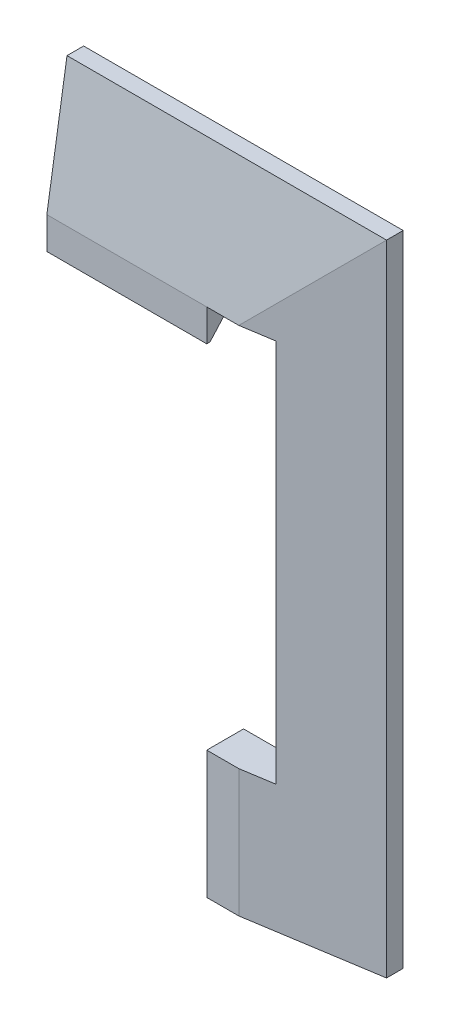
ISO-10303-21;
HEADER;
FILE_DESCRIPTION(('STEP AP214'),'2;1');
FILE_NAME('part.step','',(''),(''),'','','');
FILE_SCHEMA(('AUTOMOTIVE_DESIGN { 1 0 10303 214 1 1 1 1 }'));
ENDSEC;
DATA;
#1=APPLICATION_CONTEXT('core data for automotive mechanical design processes');
#2=APPLICATION_PROTOCOL_DEFINITION('international standard','automotive_design',2000,#1);
#3=PRODUCT_CONTEXT('',#1,'mechanical');
#4=PRODUCT('Part','Part','',(#3));
#5=PRODUCT_RELATED_PRODUCT_CATEGORY('part','',(#4));
#6=PRODUCT_DEFINITION_FORMATION('','',#4);
#7=PRODUCT_DEFINITION_CONTEXT('part definition',#1,'design');
#8=PRODUCT_DEFINITION('design','',#6,#7);
#9=PRODUCT_DEFINITION_SHAPE('','',#8);
#10=(LENGTH_UNIT() NAMED_UNIT(*) SI_UNIT(.MILLI.,.METRE.));
#11=(NAMED_UNIT(*) PLANE_ANGLE_UNIT() SI_UNIT($,.RADIAN.));
#12=(NAMED_UNIT(*) SI_UNIT($,.STERADIAN.) SOLID_ANGLE_UNIT());
#13=UNCERTAINTY_MEASURE_WITH_UNIT(LENGTH_MEASURE(1.E-05),#10,'distance_accuracy_value','');
#14=(GEOMETRIC_REPRESENTATION_CONTEXT(3) GLOBAL_UNCERTAINTY_ASSIGNED_CONTEXT((#13)) GLOBAL_UNIT_ASSIGNED_CONTEXT((#10,
#11,#12)) REPRESENTATION_CONTEXT('',''));
#15=CARTESIAN_POINT('',(0.,0.,0.));
#16=DIRECTION('',(0.,0.,1.));
#17=DIRECTION('',(1.,0.,0.));
#18=AXIS2_PLACEMENT_3D('',#15,#16,#17);
#19=CARTESIAN_POINT('',(53.4329718987957,83.245366469038,5.2));
#20=DIRECTION('',(1.,0.,0.));
#21=DIRECTION('',(0.,1.,0.));
#22=AXIS2_PLACEMENT_3D('',#19,#20,#21);
#23=PLANE('',#22);
#24=DIRECTION('',(0.,0.987762965329069,-0.155962573473011));
#25=VECTOR('',#24,1.);
#26=CARTESIAN_POINT('',(53.4329718987957,243.145366469038,11.5));
#27=LINE('',#26,#25);
#28=CARTESIAN_POINT('',(53.4329718987957,243.145366469038,11.5));
#29=VERTEX_POINT('',#28);
#30=CARTESIAN_POINT('',(53.4329718987957,283.045366469038,5.2));
#31=VERTEX_POINT('',#30);
#32=EDGE_CURVE('E532',#29,#31,#27,.T.);
#33=ORIENTED_EDGE('',*,*,#32,.T.);
#34=DIRECTION('',(0.,0.,-1.));
#35=VECTOR('',#34,1.);
#36=CARTESIAN_POINT('',(53.4329718987957,283.045366469038,5.2));
#37=LINE('',#36,#35);
#38=CARTESIAN_POINT('',(53.4329718987957,283.045366469038,0.));
#39=VERTEX_POINT('',#38);
#40=EDGE_CURVE('E438',#31,#39,#37,.T.);
#41=ORIENTED_EDGE('',*,*,#40,.T.);
#42=DIRECTION('',(0.,-1.,0.));
#43=VECTOR('',#42,1.);
#44=CARTESIAN_POINT('',(53.4329718987957,243.145366469038,0.));
#45=LINE('',#44,#43);
#46=CARTESIAN_POINT('',(53.4329718987957,243.145366469038,0.));
#47=VERTEX_POINT('',#46);
#48=EDGE_CURVE('E522',#39,#47,#45,.T.);
#49=ORIENTED_EDGE('',*,*,#48,.T.);
#50=DIRECTION('',(0.,0.,-1.));
#51=VECTOR('',#50,1.);
#52=CARTESIAN_POINT('',(53.4329718987957,243.145366469038,5.2));
#53=LINE('',#52,#51);
#54=CARTESIAN_POINT('',(53.4329718987957,243.145366469038,1.5));
#55=VERTEX_POINT('',#54);
#56=EDGE_CURVE('E433',#55,#47,#53,.T.);
#57=ORIENTED_EDGE('',*,*,#56,.F.);
#58=DIRECTION('',(0.,0.743294146247167,-0.668964731622449));
#59=VECTOR('',#58,1.);
#60=CARTESIAN_POINT('',(53.4329718987957,243.145366469038,1.5));
#61=LINE('',#60,#59);
#62=CARTESIAN_POINT('',(53.4329718987957,233.145366469038,10.5));
#63=VERTEX_POINT('',#62);
#64=EDGE_CURVE('E250',#63,#55,#61,.T.);
#65=ORIENTED_EDGE('',*,*,#64,.F.);
#66=DIRECTION('',(0.,0.,-1.));
#67=VECTOR('',#66,1.);
#68=CARTESIAN_POINT('',(53.4329718987957,233.145366469038,10.5));
#69=LINE('',#68,#67);
#70=CARTESIAN_POINT('',(53.4329718987957,233.145366469038,11.5));
#71=VERTEX_POINT('',#70);
#72=EDGE_CURVE('E617',#71,#63,#69,.T.);
#73=ORIENTED_EDGE('',*,*,#72,.F.);
#74=DIRECTION('',(0.,-1.,0.));
#75=VECTOR('',#74,1.);
#76=CARTESIAN_POINT('',(53.4329718987957,233.145366469038,11.5));
#77=LINE('',#76,#75);
#78=EDGE_CURVE('E254',#29,#71,#77,.T.);
#79=ORIENTED_EDGE('',*,*,#78,.F.);
#80=EDGE_LOOP('',(#33,#41,#49,#57,#65,#73,#79));
#81=FACE_BOUND('',#80,.T.);
#82=ADVANCED_FACE('F60',(#81),#23,.F.);
#83=CARTESIAN_POINT('',(71.9758043168465,166.490732938076,11.5));
#84=DIRECTION('',(0.,0.,-1.));
#85=DIRECTION('',(1.,0.,0.));
#86=AXIS2_PLACEMENT_3D('',#83,#84,#85);
#87=PLANE('',#86);
#88=DIRECTION('',(1.,0.,0.));
#89=VECTOR('',#88,1.);
#90=CARTESIAN_POINT('',(71.9758043168466,123.145366469038,11.5));
#91=LINE('',#90,#89);
#92=CARTESIAN_POINT('',(103.432971898796,123.145366469038,11.5));
#93=VERTEX_POINT('',#92);
#94=CARTESIAN_POINT('',(113.432971898796,123.145366469038,11.5));
#95=VERTEX_POINT('',#94);
#96=EDGE_CURVE('E355',#93,#95,#91,.T.);
#97=ORIENTED_EDGE('',*,*,#96,.F.);
#98=DIRECTION('',(0.,1.,0.));
#99=VECTOR('',#98,1.);
#100=CARTESIAN_POINT('',(103.432971898796,83.245366469038,11.5));
#101=LINE('',#100,#99);
#102=CARTESIAN_POINT('',(103.432971898796,83.245366469038,11.5));
#103=VERTEX_POINT('',#102);
#104=EDGE_CURVE('E269',#103,#93,#101,.T.);
#105=ORIENTED_EDGE('',*,*,#104,.F.);
#106=CARTESIAN_POINT('',(103.432971898796,83.245366469038,11.5));
#107=DIRECTION('',(1.,0.,0.));
#108=VECTOR('',#107,1.);
#109=LINE('',#106,#108);
#110=CARTESIAN_POINT('',(113.432971898796,83.245366469038,11.5));
#111=VERTEX_POINT('',#110);
#112=EDGE_CURVE('E419',#103,#111,#109,.T.);
#113=ORIENTED_EDGE('',*,*,#112,.T.);
#114=CARTESIAN_POINT('',(113.432971898796,83.245366469038,11.5));
#115=DIRECTION('',(0.,1.,0.));
#116=VECTOR('',#115,1.);
#117=LINE('',#114,#116);
#118=EDGE_CURVE('E536',#111,#95,#117,.T.);
#119=ORIENTED_EDGE('',*,*,#118,.T.);
#120=EDGE_LOOP('',(#97,#105,#113,#119));
#121=FACE_BOUND('',#120,.T.);
#122=ADVANCED_FACE('F494',(#121),#87,.F.);
#123=CARTESIAN_POINT('',(74.7558435282994,166.490732938076,17.6069150058678));
#124=DIRECTION('',(0.155962573473011,0.,0.987762965329069));
#125=DIRECTION('',(-0.987762965329069,0.,0.155962573473011));
#126=AXIS2_PLACEMENT_3D('',#123,#124,#125);
#127=PLANE('',#126);
#128=DIRECTION('',(0.,1.,0.));
#129=VECTOR('',#128,1.);
#130=CARTESIAN_POINT('',(123.432971898796,166.490732938076,9.92105263157894));
#131=LINE('',#130,#129);
#132=CARTESIAN_POINT('',(123.432971898796,123.145366469038,9.92105263157894));
#133=VERTEX_POINT('',#132);
#134=CARTESIAN_POINT('',(123.432971898796,243.145366469038,9.92105263157894));
#135=VERTEX_POINT('',#134);
#136=EDGE_CURVE('E454',#133,#135,#131,.T.);
#137=ORIENTED_EDGE('',*,*,#136,.F.);
#138=DIRECTION('',(-0.987762965329069,0.,0.155962573473011));
#139=VECTOR('',#138,1.);
#140=CARTESIAN_POINT('',(74.7558435282994,123.145366469038,17.6069150058678));
#141=LINE('',#140,#139);
#142=EDGE_CURVE('E631',#133,#95,#141,.T.);
#143=ORIENTED_EDGE('',*,*,#142,.T.);
#144=ORIENTED_EDGE('',*,*,#118,.F.);
#145=DIRECTION('',(0.987762965329069,0.,-0.155962573473011));
#146=VECTOR('',#145,1.);
#147=CARTESIAN_POINT('',(113.432971898796,83.245366469038,11.5));
#148=LINE('',#147,#146);
#149=CARTESIAN_POINT('',(153.332971898796,83.245366469038,5.2));
#150=VERTEX_POINT('',#149);
#151=EDGE_CURVE('E541',#111,#150,#148,.T.);
#152=ORIENTED_EDGE('',*,*,#151,.T.);
#153=DIRECTION('',(0.,-1.,0.));
#154=VECTOR('',#153,1.);
#155=CARTESIAN_POINT('',(153.332971898796,166.490732938076,5.2));
#156=LINE('',#155,#154);
#157=CARTESIAN_POINT('',(153.332971898796,283.045366469038,5.2));
#158=VERTEX_POINT('',#157);
#159=EDGE_CURVE('E465',#150,#158,#156,.F.);
#160=ORIENTED_EDGE('',*,*,#159,.T.);
#161=DIRECTION('',(0.702740385382544,0.702740385382543,-0.110959008218296));
#162=VECTOR('',#161,1.);
#163=CARTESIAN_POINT('',(113.432971898796,243.145366469038,11.5));
#164=LINE('',#163,#162);
#165=CARTESIAN_POINT('',(113.432971898796,243.145366469038,11.5));
#166=VERTEX_POINT('',#165);
#167=EDGE_CURVE('E535',#166,#158,#164,.T.);
#168=ORIENTED_EDGE('',*,*,#167,.F.);
#169=DIRECTION('',(0.987762965329069,0.,-0.155962573473011));
#170=VECTOR('',#169,1.);
#171=CARTESIAN_POINT('',(74.7558435282993,243.145366469038,17.6069150058678));
#172=LINE('',#171,#170);
#173=EDGE_CURVE('E629',#166,#135,#172,.T.);
#174=ORIENTED_EDGE('',*,*,#173,.T.);
#175=EDGE_LOOP('',(#137,#143,#144,#152,#160,#168,#174));
#176=FACE_BOUND('',#175,.T.);
#177=ADVANCED_FACE('F512',(#176),#127,.T.);
#178=CARTESIAN_POINT('',(153.332971898796,83.245366469038,5.2));
#179=DIRECTION('',(-1.,0.,0.));
#180=DIRECTION('',(0.,-1.,0.));
#181=AXIS2_PLACEMENT_3D('',#178,#179,#180);
#182=PLANE('',#181);
#183=DIRECTION('',(0.,1.,0.));
#184=VECTOR('',#183,1.);
#185=CARTESIAN_POINT('',(153.332971898796,83.245366469038,0.));
#186=LINE('',#185,#184);
#187=CARTESIAN_POINT('',(153.332971898796,83.245366469038,0.));
#188=VERTEX_POINT('',#187);
#189=CARTESIAN_POINT('',(153.332971898796,283.045366469038,0.));
#190=VERTEX_POINT('',#189);
#191=EDGE_CURVE('E523',#188,#190,#186,.T.);
#192=ORIENTED_EDGE('',*,*,#191,.T.);
#193=DIRECTION('',(0.,0.,-1.));
#194=VECTOR('',#193,1.);
#195=CARTESIAN_POINT('',(153.332971898796,283.045366469038,5.2));
#196=LINE('',#195,#194);
#197=EDGE_CURVE('E448',#158,#190,#196,.T.);
#198=ORIENTED_EDGE('',*,*,#197,.F.);
#199=ORIENTED_EDGE('',*,*,#159,.F.);
#200=DIRECTION('',(0.,0.,-1.));
#201=VECTOR('',#200,1.);
#202=CARTESIAN_POINT('',(153.332971898796,83.245366469038,5.2));
#203=LINE('',#202,#201);
#204=EDGE_CURVE('E455',#150,#188,#203,.T.);
#205=ORIENTED_EDGE('',*,*,#204,.T.);
#206=EDGE_LOOP('',(#192,#198,#199,#205));
#207=FACE_BOUND('',#206,.T.);
#208=ADVANCED_FACE('F62',(#207),#182,.F.);
#209=CARTESIAN_POINT('',(153.332971898796,283.045366469038,5.2));
#210=DIRECTION('',(0.,-1.,0.));
#211=DIRECTION('',(1.,0.,0.));
#212=AXIS2_PLACEMENT_3D('',#209,#210,#211);
#213=PLANE('',#212);
#214=DIRECTION('',(-1.,0.,0.));
#215=VECTOR('',#214,1.);
#216=CARTESIAN_POINT('',(153.332971898796,283.045366469038,0.));
#217=LINE('',#216,#215);
#218=EDGE_CURVE('E515',#190,#39,#217,.T.);
#219=ORIENTED_EDGE('',*,*,#218,.T.);
#220=ORIENTED_EDGE('',*,*,#40,.F.);
#221=DIRECTION('',(-1.,0.,0.));
#222=VECTOR('',#221,1.);
#223=CARTESIAN_POINT('',(71.9758043168465,283.045366469038,5.2));
#224=LINE('',#223,#222);
#225=EDGE_CURVE('E460',#158,#31,#224,.T.);
#226=ORIENTED_EDGE('',*,*,#225,.F.);
#227=ORIENTED_EDGE('',*,*,#197,.T.);
#228=EDGE_LOOP('',(#219,#220,#226,#227));
#229=FACE_BOUND('',#228,.T.);
#230=ADVANCED_FACE('F505',(#229),#213,.F.);
#231=CARTESIAN_POINT('',(123.432971898796,243.145366469038,5.2));
#232=DIRECTION('',(0.,1.,0.));
#233=DIRECTION('',(-1.,0.,0.));
#234=AXIS2_PLACEMENT_3D('',#231,#232,#233);
#235=PLANE('',#234);
#236=ORIENTED_EDGE('',*,*,#56,.T.);
#237=DIRECTION('',(1.,0.,0.));
#238=VECTOR('',#237,1.);
#239=CARTESIAN_POINT('',(123.432971898796,243.145366469038,0.));
#240=LINE('',#239,#238);
#241=CARTESIAN_POINT('',(123.432971898796,243.145366469038,0.));
#242=VERTEX_POINT('',#241);
#243=EDGE_CURVE('E527',#47,#242,#240,.T.);
#244=ORIENTED_EDGE('',*,*,#243,.T.);
#245=DIRECTION('',(0.,0.,-1.));
#246=VECTOR('',#245,1.);
#247=CARTESIAN_POINT('',(123.432971898796,243.145366469038,5.2));
#248=LINE('',#247,#246);
#249=EDGE_CURVE('E439',#135,#242,#248,.T.);
#250=ORIENTED_EDGE('',*,*,#249,.F.);
#251=ORIENTED_EDGE('',*,*,#173,.F.);
#252=DIRECTION('',(-1.,0.,0.));
#253=VECTOR('',#252,1.);
#254=CARTESIAN_POINT('',(113.432971898796,243.145366469038,11.5));
#255=LINE('',#254,#253);
#256=CARTESIAN_POINT('',(103.432971898796,243.145366469038,11.5));
#257=VERTEX_POINT('',#256);
#258=EDGE_CURVE('E544',#166,#257,#255,.T.);
#259=ORIENTED_EDGE('',*,*,#258,.T.);
#260=DIRECTION('',(0.,0.,1.));
#261=VECTOR('',#260,1.);
#262=CARTESIAN_POINT('',(103.432971898796,243.145366469038,11.5));
#263=LINE('',#262,#261);
#264=CARTESIAN_POINT('',(103.432971898796,243.145366469038,1.5));
#265=VERTEX_POINT('',#264);
#266=EDGE_CURVE('E245',#265,#257,#263,.T.);
#267=ORIENTED_EDGE('',*,*,#266,.F.);
#268=DIRECTION('',(-1.,0.,0.));
#269=VECTOR('',#268,1.);
#270=CARTESIAN_POINT('',(103.432971898796,243.145366469038,1.5));
#271=LINE('',#270,#269);
#272=EDGE_CURVE('E260',#265,#55,#271,.T.);
#273=ORIENTED_EDGE('',*,*,#272,.T.);
#274=EDGE_LOOP('',(#236,#244,#250,#251,#259,#267,#273));
#275=FACE_BOUND('',#274,.T.);
#276=ADVANCED_FACE('F502',(#275),#235,.F.);
#277=CARTESIAN_POINT('',(123.432971898796,123.145366469038,5.2));
#278=DIRECTION('',(1.,0.,0.));
#279=DIRECTION('',(0.,1.,0.));
#280=AXIS2_PLACEMENT_3D('',#277,#278,#279);
#281=PLANE('',#280);
#282=DIRECTION('',(0.,-1.,0.));
#283=VECTOR('',#282,1.);
#284=CARTESIAN_POINT('',(123.432971898796,123.145366469038,0.));
#285=LINE('',#284,#283);
#286=CARTESIAN_POINT('',(123.432971898796,123.145366469038,0.));
#287=VERTEX_POINT('',#286);
#288=EDGE_CURVE('E595',#242,#287,#285,.T.);
#289=ORIENTED_EDGE('',*,*,#288,.T.);
#290=DIRECTION('',(0.,0.,-1.));
#291=VECTOR('',#290,1.);
#292=CARTESIAN_POINT('',(123.432971898796,123.145366469038,5.2));
#293=LINE('',#292,#291);
#294=EDGE_CURVE('E459',#133,#287,#293,.T.);
#295=ORIENTED_EDGE('',*,*,#294,.F.);
#296=ORIENTED_EDGE('',*,*,#136,.T.);
#297=ORIENTED_EDGE('',*,*,#249,.T.);
#298=EDGE_LOOP('',(#289,#295,#296,#297));
#299=FACE_BOUND('',#298,.T.);
#300=CARTESIAN_POINT('',(123.432971898796,163.245366469038,5.12));
#301=DIRECTION('',(-1.,0.,0.));
#302=DIRECTION('',(0.,-1.,0.));
#303=AXIS2_PLACEMENT_3D('',#300,#301,#302);
#304=CIRCLE('',#303,1.2);
#305=CARTESIAN_POINT('',(123.432971898796,162.045366469038,5.12));
#306=VERTEX_POINT('',#305);
#307=EDGE_CURVE('E298',#306,#306,#304,.T.);
#308=ORIENTED_EDGE('',*,*,#307,.F.);
#309=EDGE_LOOP('',(#308));
#310=FACE_BOUND('',#309,.T.);
#311=CARTESIAN_POINT('',(123.432971898796,203.045366469038,5.12));
#312=DIRECTION('',(-1.,0.,0.));
#313=DIRECTION('',(0.,-1.,0.));
#314=AXIS2_PLACEMENT_3D('',#311,#312,#313);
#315=CIRCLE('',#314,1.2);
#316=CARTESIAN_POINT('',(123.432971898796,201.845366469038,5.12));
#317=VERTEX_POINT('',#316);
#318=EDGE_CURVE('E270',#317,#317,#315,.T.);
#319=ORIENTED_EDGE('',*,*,#318,.F.);
#320=EDGE_LOOP('',(#319));
#321=FACE_BOUND('',#320,.T.);
#322=ADVANCED_FACE('F498',(#299,#310,#321),#281,.F.);
#323=CARTESIAN_POINT('',(123.432971898796,123.145366469038,5.2));
#324=DIRECTION('',(0.,-1.,0.));
#325=DIRECTION('',(0.,0.,1.));
#326=AXIS2_PLACEMENT_3D('',#323,#324,#325);
#327=PLANE('',#326);
#328=DIRECTION('',(-1.,0.,0.));
#329=VECTOR('',#328,1.);
#330=CARTESIAN_POINT('',(123.432971898796,123.145366469038,0.));
#331=LINE('',#330,#329);
#332=CARTESIAN_POINT('',(103.432971898796,123.145366469038,0.));
#333=VERTEX_POINT('',#332);
#334=EDGE_CURVE('E599',#287,#333,#331,.T.);
#335=ORIENTED_EDGE('',*,*,#334,.T.);
#336=DIRECTION('',(0.,0.,1.));
#337=VECTOR('',#336,1.);
#338=CARTESIAN_POINT('',(103.432971898796,123.145366469038,-12.5));
#339=LINE('',#338,#337);
#340=EDGE_CURVE('E265',#333,#93,#339,.T.);
#341=ORIENTED_EDGE('',*,*,#340,.T.);
#342=ORIENTED_EDGE('',*,*,#96,.T.);
#343=ORIENTED_EDGE('',*,*,#142,.F.);
#344=ORIENTED_EDGE('',*,*,#294,.T.);
#345=EDGE_LOOP('',(#335,#341,#342,#343,#344));
#346=FACE_BOUND('',#345,.T.);
#347=ADVANCED_FACE('F489',(#346),#327,.F.);
#348=CARTESIAN_POINT('',(153.332971898796,83.245366469038,5.2));
#349=DIRECTION('',(0.,1.,0.));
#350=DIRECTION('',(-1.,0.,0.));
#351=AXIS2_PLACEMENT_3D('',#348,#349,#350);
#352=PLANE('',#351);
#353=ORIENTED_EDGE('',*,*,#112,.F.);
#354=DIRECTION('',(0.,0.,1.));
#355=VECTOR('',#354,1.);
#356=CARTESIAN_POINT('',(103.432971898796,83.245366469038,-12.5));
#357=LINE('',#356,#355);
#358=CARTESIAN_POINT('',(103.432971898796,83.245366469038,0.));
#359=VERTEX_POINT('',#358);
#360=EDGE_CURVE('E268',#359,#103,#357,.T.);
#361=ORIENTED_EDGE('',*,*,#360,.F.);
#362=DIRECTION('',(1.,0.,0.));
#363=VECTOR('',#362,1.);
#364=CARTESIAN_POINT('',(153.332971898796,83.245366469038,0.));
#365=LINE('',#364,#363);
#366=EDGE_CURVE('E471',#359,#188,#365,.T.);
#367=ORIENTED_EDGE('',*,*,#366,.T.);
#368=ORIENTED_EDGE('',*,*,#204,.F.);
#369=ORIENTED_EDGE('',*,*,#151,.F.);
#370=EDGE_LOOP('',(#353,#361,#367,#368,#369));
#371=FACE_BOUND('',#370,.T.);
#372=ADVANCED_FACE('F478',(#371),#352,.F.);
#373=CARTESIAN_POINT('',(71.9758043168465,166.490732938076,0.));
#374=DIRECTION('',(0.,0.,1.));
#375=DIRECTION('',(-1.,0.,0.));
#376=AXIS2_PLACEMENT_3D('',#373,#374,#375);
#377=PLANE('',#376);
#378=ORIENTED_EDGE('',*,*,#366,.F.);
#379=DIRECTION('',(0.,1.,0.));
#380=VECTOR('',#379,1.);
#381=CARTESIAN_POINT('',(103.432971898796,166.490732938076,0.));
#382=LINE('',#381,#380);
#383=EDGE_CURVE('E12',#359,#333,#382,.T.);
#384=ORIENTED_EDGE('',*,*,#383,.T.);
#385=ORIENTED_EDGE('',*,*,#334,.F.);
#386=ORIENTED_EDGE('',*,*,#288,.F.);
#387=ORIENTED_EDGE('',*,*,#243,.F.);
#388=ORIENTED_EDGE('',*,*,#48,.F.);
#389=ORIENTED_EDGE('',*,*,#218,.F.);
#390=ORIENTED_EDGE('',*,*,#191,.F.);
#391=EDGE_LOOP('',(#378,#384,#385,#386,#387,#388,#389,#390));
#392=FACE_BOUND('',#391,.T.);
#393=ADVANCED_FACE('F488',(#392),#377,.F.);
#394=CARTESIAN_POINT('',(71.9758043168465,170.126926726667,23.0292273277428));
#395=DIRECTION('',(0.,0.155962573473011,0.987762965329069));
#396=DIRECTION('',(0.,0.987762965329069,-0.155962573473011));
#397=AXIS2_PLACEMENT_3D('',#394,#395,#396);
#398=PLANE('',#397);
#399=ORIENTED_EDGE('',*,*,#167,.T.);
#400=ORIENTED_EDGE('',*,*,#225,.T.);
#401=ORIENTED_EDGE('',*,*,#32,.F.);
#402=DIRECTION('',(-1.,0.,0.));
#403=VECTOR('',#402,1.);
#404=CARTESIAN_POINT('',(103.432971898796,243.145366469038,11.5));
#405=LINE('',#404,#403);
#406=EDGE_CURVE('E430',#257,#29,#405,.T.);
#407=ORIENTED_EDGE('',*,*,#406,.F.);
#408=ORIENTED_EDGE('',*,*,#258,.F.);
#409=EDGE_LOOP('',(#399,#400,#401,#407,#408));
#410=FACE_BOUND('',#409,.T.);
#411=ADVANCED_FACE('F572',(#410),#398,.T.);
#412=CARTESIAN_POINT('',(127.232971898796,163.245366469038,5.12));
#413=DIRECTION('',(-1.,0.,0.));
#414=DIRECTION('',(0.,-1.,0.));
#415=AXIS2_PLACEMENT_3D('',#412,#413,#414);
#416=PLANE('',#415);
#417=CARTESIAN_POINT('',(127.232971898796,163.245366469038,5.12));
#418=DIRECTION('',(-1.,0.,0.));
#419=DIRECTION('',(0.,-1.,0.));
#420=AXIS2_PLACEMENT_3D('',#417,#418,#419);
#421=CIRCLE('',#420,1.2);
#422=CARTESIAN_POINT('',(127.232971898796,162.045366469038,5.12));
#423=VERTEX_POINT('',#422);
#424=EDGE_CURVE('E299',#423,#423,#421,.T.);
#425=ORIENTED_EDGE('',*,*,#424,.T.);
#426=EDGE_LOOP('',(#425));
#427=FACE_BOUND('',#426,.T.);
#428=DIRECTION('',(0.,-0.5,-0.866025403784438));
#429=VECTOR('',#428,1.);
#430=CARTESIAN_POINT('',(127.232971898796,160.820495338442,5.12));
#431=LINE('',#430,#429);
#432=CARTESIAN_POINT('',(127.232971898796,162.03293090374,7.22));
#433=VERTEX_POINT('',#432);
#434=CARTESIAN_POINT('',(127.232971898796,160.820495338442,5.12));
#435=VERTEX_POINT('',#434);
#436=EDGE_CURVE('E642',#433,#435,#431,.T.);
#437=ORIENTED_EDGE('',*,*,#436,.T.);
#438=DIRECTION('',(0.,0.5,-0.866025403784439));
#439=VECTOR('',#438,1.);
#440=CARTESIAN_POINT('',(127.232971898796,162.03293090374,3.02));
#441=LINE('',#440,#439);
#442=CARTESIAN_POINT('',(127.232971898796,162.03293090374,3.02));
#443=VERTEX_POINT('',#442);
#444=EDGE_CURVE('E322',#435,#443,#441,.T.);
#445=ORIENTED_EDGE('',*,*,#444,.T.);
#446=DIRECTION('',(0.,1.,0.));
#447=VECTOR('',#446,1.);
#448=CARTESIAN_POINT('',(127.232971898796,164.457802034336,3.02));
#449=LINE('',#448,#447);
#450=CARTESIAN_POINT('',(127.232971898796,164.457802034336,3.02));
#451=VERTEX_POINT('',#450);
#452=EDGE_CURVE('E318',#443,#451,#449,.T.);
#453=ORIENTED_EDGE('',*,*,#452,.T.);
#454=DIRECTION('',(0.,0.5,0.866025403784439));
#455=VECTOR('',#454,1.);
#456=CARTESIAN_POINT('',(127.232971898796,165.670237599634,5.12));
#457=LINE('',#456,#455);
#458=CARTESIAN_POINT('',(127.232971898796,165.670237599634,5.12));
#459=VERTEX_POINT('',#458);
#460=EDGE_CURVE('E314',#451,#459,#457,.T.);
#461=ORIENTED_EDGE('',*,*,#460,.T.);
#462=DIRECTION('',(0.,-0.5,0.866025403784439));
#463=VECTOR('',#462,1.);
#464=CARTESIAN_POINT('',(127.232971898796,164.457802034336,7.22));
#465=LINE('',#464,#463);
#466=CARTESIAN_POINT('',(127.232971898796,164.457802034336,7.22));
#467=VERTEX_POINT('',#466);
#468=EDGE_CURVE('E310',#459,#467,#465,.T.);
#469=ORIENTED_EDGE('',*,*,#468,.T.);
#470=DIRECTION('',(0.,-1.,0.));
#471=VECTOR('',#470,1.);
#472=CARTESIAN_POINT('',(127.232971898796,162.03293090374,7.22));
#473=LINE('',#472,#471);
#474=EDGE_CURVE('E303',#467,#433,#473,.T.);
#475=ORIENTED_EDGE('',*,*,#474,.T.);
#476=EDGE_LOOP('',(#437,#445,#453,#461,#469,#475));
#477=FACE_BOUND('',#476,.T.);
#478=ADVANCED_FACE('F575',(#427,#477),#416,.F.);
#479=CARTESIAN_POINT('',(127.232971898796,163.245366469038,5.12));
#480=DIRECTION('',(-1.,0.,0.));
#481=DIRECTION('',(0.,-1.,0.));
#482=AXIS2_PLACEMENT_3D('',#479,#480,#481);
#483=CYLINDRICAL_SURFACE('',#482,1.2);
#484=ORIENTED_EDGE('',*,*,#424,.F.);
#485=EDGE_LOOP('',(#484));
#486=FACE_BOUND('',#485,.T.);
#487=ORIENTED_EDGE('',*,*,#307,.T.);
#488=EDGE_LOOP('',(#487));
#489=FACE_BOUND('',#488,.T.);
#490=ADVANCED_FACE('F681',(#486,#489),#483,.F.);
#491=CARTESIAN_POINT('',(129.032971898796,166.490732938076,0.));
#492=DIRECTION('',(-1.,0.,0.));
#493=DIRECTION('',(0.,0.,-1.));
#494=AXIS2_PLACEMENT_3D('',#491,#492,#493);
#495=PLANE('',#494);
#496=DIRECTION('',(0.,-0.5,0.866025403784439));
#497=VECTOR('',#496,1.);
#498=CARTESIAN_POINT('',(129.032971898796,162.03293090374,3.02));
#499=LINE('',#498,#497);
#500=CARTESIAN_POINT('',(129.032971898796,162.03293090374,3.02));
#501=VERTEX_POINT('',#500);
#502=CARTESIAN_POINT('',(129.032971898796,160.820495338442,5.12));
#503=VERTEX_POINT('',#502);
#504=EDGE_CURVE('E332',#501,#503,#499,.T.);
#505=ORIENTED_EDGE('',*,*,#504,.T.);
#506=DIRECTION('',(0.,0.5,0.866025403784438));
#507=VECTOR('',#506,1.);
#508=CARTESIAN_POINT('',(129.032971898796,160.820495338442,5.12));
#509=LINE('',#508,#507);
#510=CARTESIAN_POINT('',(129.032971898796,162.03293090374,7.22));
#511=VERTEX_POINT('',#510);
#512=EDGE_CURVE('E403',#503,#511,#509,.T.);
#513=ORIENTED_EDGE('',*,*,#512,.T.);
#514=DIRECTION('',(0.,1.,0.));
#515=VECTOR('',#514,1.);
#516=CARTESIAN_POINT('',(129.032971898796,162.03293090374,7.22));
#517=LINE('',#516,#515);
#518=CARTESIAN_POINT('',(129.032971898796,164.457802034336,7.22));
#519=VERTEX_POINT('',#518);
#520=EDGE_CURVE('E399',#511,#519,#517,.T.);
#521=ORIENTED_EDGE('',*,*,#520,.T.);
#522=DIRECTION('',(0.,0.5,-0.866025403784439));
#523=VECTOR('',#522,1.);
#524=CARTESIAN_POINT('',(129.032971898796,164.457802034336,7.22));
#525=LINE('',#524,#523);
#526=CARTESIAN_POINT('',(129.032971898796,165.670237599634,5.12));
#527=VERTEX_POINT('',#526);
#528=EDGE_CURVE('E395',#519,#527,#525,.T.);
#529=ORIENTED_EDGE('',*,*,#528,.T.);
#530=DIRECTION('',(0.,-0.5,-0.866025403784439));
#531=VECTOR('',#530,1.);
#532=CARTESIAN_POINT('',(129.032971898796,165.670237599634,5.12));
#533=LINE('',#532,#531);
#534=CARTESIAN_POINT('',(129.032971898796,164.457802034336,3.02));
#535=VERTEX_POINT('',#534);
#536=EDGE_CURVE('E391',#527,#535,#533,.T.);
#537=ORIENTED_EDGE('',*,*,#536,.T.);
#538=DIRECTION('',(0.,-1.,0.));
#539=VECTOR('',#538,1.);
#540=CARTESIAN_POINT('',(129.032971898796,164.457802034336,3.02));
#541=LINE('',#540,#539);
#542=EDGE_CURVE('E373',#535,#501,#541,.T.);
#543=ORIENTED_EDGE('',*,*,#542,.T.);
#544=EDGE_LOOP('',(#505,#513,#521,#529,#537,#543));
#545=FACE_BOUND('',#544,.T.);
#546=ADVANCED_FACE('F570',(#545),#495,.T.);
#547=CARTESIAN_POINT('',(129.032971898796,160.820495338442,5.12));
#548=DIRECTION('',(0.,-0.866025403784438,0.5));
#549=DIRECTION('',(0.,0.5,0.866025403784438));
#550=AXIS2_PLACEMENT_3D('',#547,#548,#549);
#551=PLANE('',#550);
#552=ORIENTED_EDGE('',*,*,#436,.F.);
#553=DIRECTION('',(-1.,0.,0.));
#554=VECTOR('',#553,1.);
#555=CARTESIAN_POINT('',(129.032971898796,162.03293090374,7.22));
#556=LINE('',#555,#554);
#557=EDGE_CURVE('E374',#511,#433,#556,.T.);
#558=ORIENTED_EDGE('',*,*,#557,.F.);
#559=ORIENTED_EDGE('',*,*,#512,.F.);
#560=DIRECTION('',(-1.,0.,0.));
#561=VECTOR('',#560,1.);
#562=CARTESIAN_POINT('',(129.032971898796,160.820495338442,5.12));
#563=LINE('',#562,#561);
#564=EDGE_CURVE('E370',#503,#435,#563,.T.);
#565=ORIENTED_EDGE('',*,*,#564,.T.);
#566=EDGE_LOOP('',(#552,#558,#559,#565));
#567=FACE_BOUND('',#566,.T.);
#568=ADVANCED_FACE('F659',(#567),#551,.F.);
#569=CARTESIAN_POINT('',(129.032971898796,162.03293090374,7.22));
#570=DIRECTION('',(0.,0.,1.));
#571=DIRECTION('',(-1.,0.,0.));
#572=AXIS2_PLACEMENT_3D('',#569,#570,#571);
#573=PLANE('',#572);
#574=ORIENTED_EDGE('',*,*,#474,.F.);
#575=DIRECTION('',(-1.,0.,0.));
#576=VECTOR('',#575,1.);
#577=CARTESIAN_POINT('',(129.032971898796,164.457802034336,7.22));
#578=LINE('',#577,#576);
#579=EDGE_CURVE('E377',#519,#467,#578,.T.);
#580=ORIENTED_EDGE('',*,*,#579,.F.);
#581=ORIENTED_EDGE('',*,*,#520,.F.);
#582=ORIENTED_EDGE('',*,*,#557,.T.);
#583=EDGE_LOOP('',(#574,#580,#581,#582));
#584=FACE_BOUND('',#583,.T.);
#585=ADVANCED_FACE('F678',(#584),#573,.F.);
#586=CARTESIAN_POINT('',(129.032971898796,164.457802034336,7.22));
#587=DIRECTION('',(0.,0.866025403784438,0.5));
#588=DIRECTION('',(0.,0.5,-0.866025403784439));
#589=AXIS2_PLACEMENT_3D('',#586,#587,#588);
#590=PLANE('',#589);
#591=ORIENTED_EDGE('',*,*,#468,.F.);
#592=DIRECTION('',(-1.,0.,0.));
#593=VECTOR('',#592,1.);
#594=CARTESIAN_POINT('',(129.032971898796,165.670237599634,5.12));
#595=LINE('',#594,#593);
#596=EDGE_CURVE('E380',#527,#459,#595,.T.);
#597=ORIENTED_EDGE('',*,*,#596,.F.);
#598=ORIENTED_EDGE('',*,*,#528,.F.);
#599=ORIENTED_EDGE('',*,*,#579,.T.);
#600=EDGE_LOOP('',(#591,#597,#598,#599));
#601=FACE_BOUND('',#600,.T.);
#602=ADVANCED_FACE('F676',(#601),#590,.F.);
#603=CARTESIAN_POINT('',(129.032971898796,165.670237599634,5.12));
#604=DIRECTION('',(0.,0.866025403784439,-0.5));
#605=DIRECTION('',(0.,-0.5,-0.866025403784439));
#606=AXIS2_PLACEMENT_3D('',#603,#604,#605);
#607=PLANE('',#606);
#608=ORIENTED_EDGE('',*,*,#460,.F.);
#609=DIRECTION('',(-1.,0.,0.));
#610=VECTOR('',#609,1.);
#611=CARTESIAN_POINT('',(129.032971898796,164.457802034336,3.02));
#612=LINE('',#611,#610);
#613=EDGE_CURVE('E383',#535,#451,#612,.T.);
#614=ORIENTED_EDGE('',*,*,#613,.F.);
#615=ORIENTED_EDGE('',*,*,#536,.F.);
#616=ORIENTED_EDGE('',*,*,#596,.T.);
#617=EDGE_LOOP('',(#608,#614,#615,#616));
#618=FACE_BOUND('',#617,.T.);
#619=ADVANCED_FACE('F672',(#618),#607,.F.);
#620=CARTESIAN_POINT('',(129.032971898796,164.457802034336,3.02));
#621=DIRECTION('',(0.,0.,-1.));
#622=DIRECTION('',(0.,-1.,0.));
#623=AXIS2_PLACEMENT_3D('',#620,#621,#622);
#624=PLANE('',#623);
#625=ORIENTED_EDGE('',*,*,#452,.F.);
#626=DIRECTION('',(-1.,0.,0.));
#627=VECTOR('',#626,1.);
#628=CARTESIAN_POINT('',(129.032971898796,162.03293090374,3.02));
#629=LINE('',#628,#627);
#630=EDGE_CURVE('E326',#501,#443,#629,.T.);
#631=ORIENTED_EDGE('',*,*,#630,.F.);
#632=ORIENTED_EDGE('',*,*,#542,.F.);
#633=ORIENTED_EDGE('',*,*,#613,.T.);
#634=EDGE_LOOP('',(#625,#631,#632,#633));
#635=FACE_BOUND('',#634,.T.);
#636=ADVANCED_FACE('F668',(#635),#624,.F.);
#637=CARTESIAN_POINT('',(129.032971898796,162.03293090374,3.02));
#638=DIRECTION('',(0.,-0.866025403784439,-0.5));
#639=DIRECTION('',(0.,-0.5,0.866025403784439));
#640=AXIS2_PLACEMENT_3D('',#637,#638,#639);
#641=PLANE('',#640);
#642=ORIENTED_EDGE('',*,*,#444,.F.);
#643=ORIENTED_EDGE('',*,*,#564,.F.);
#644=ORIENTED_EDGE('',*,*,#504,.F.);
#645=ORIENTED_EDGE('',*,*,#630,.T.);
#646=EDGE_LOOP('',(#642,#643,#644,#645));
#647=FACE_BOUND('',#646,.T.);
#648=ADVANCED_FACE('F664',(#647),#641,.F.);
#649=CARTESIAN_POINT('',(127.232971898796,203.045366469038,5.12));
#650=DIRECTION('',(-1.,0.,0.));
#651=DIRECTION('',(0.,-1.,0.));
#652=AXIS2_PLACEMENT_3D('',#649,#650,#651);
#653=PLANE('',#652);
#654=CARTESIAN_POINT('',(127.232971898796,203.045366469038,5.12));
#655=DIRECTION('',(-1.,0.,0.));
#656=DIRECTION('',(0.,-1.,0.));
#657=AXIS2_PLACEMENT_3D('',#654,#655,#656);
#658=CIRCLE('',#657,1.2);
#659=CARTESIAN_POINT('',(127.232971898796,201.845366469038,5.12));
#660=VERTEX_POINT('',#659);
#661=EDGE_CURVE('E275',#660,#660,#658,.T.);
#662=ORIENTED_EDGE('',*,*,#661,.T.);
#663=EDGE_LOOP('',(#662));
#664=FACE_BOUND('',#663,.T.);
#665=DIRECTION('',(0.,-0.5,-0.866025403784439));
#666=VECTOR('',#665,1.);
#667=CARTESIAN_POINT('',(127.232971898796,200.620495338442,5.11999999999999));
#668=LINE('',#667,#666);
#669=CARTESIAN_POINT('',(127.232971898796,201.83293090374,7.22));
#670=VERTEX_POINT('',#669);
#671=CARTESIAN_POINT('',(127.232971898796,200.620495338442,5.11999999999999));
#672=VERTEX_POINT('',#671);
#673=EDGE_CURVE('E70',#670,#672,#668,.T.);
#674=ORIENTED_EDGE('',*,*,#673,.T.);
#675=DIRECTION('',(0.,0.500000000000002,-0.866025403784438));
#676=VECTOR('',#675,1.);
#677=CARTESIAN_POINT('',(127.232971898796,201.83293090374,3.02));
#678=LINE('',#677,#676);
#679=CARTESIAN_POINT('',(127.232971898796,201.83293090374,3.02));
#680=VERTEX_POINT('',#679);
#681=EDGE_CURVE('E294',#672,#680,#678,.T.);
#682=ORIENTED_EDGE('',*,*,#681,.T.);
#683=DIRECTION('',(0.,1.,0.));
#684=VECTOR('',#683,1.);
#685=CARTESIAN_POINT('',(127.232971898796,204.257802034336,3.02));
#686=LINE('',#685,#684);
#687=CARTESIAN_POINT('',(127.232971898796,204.257802034336,3.02));
#688=VERTEX_POINT('',#687);
#689=EDGE_CURVE('E290',#680,#688,#686,.T.);
#690=ORIENTED_EDGE('',*,*,#689,.T.);
#691=DIRECTION('',(0.,0.500000000000002,0.866025403784438));
#692=VECTOR('',#691,1.);
#693=CARTESIAN_POINT('',(127.232971898796,205.470237599634,5.11999999999999));
#694=LINE('',#693,#692);
#695=CARTESIAN_POINT('',(127.232971898796,205.470237599634,5.11999999999999));
#696=VERTEX_POINT('',#695);
#697=EDGE_CURVE('E286',#688,#696,#694,.T.);
#698=ORIENTED_EDGE('',*,*,#697,.T.);
#699=DIRECTION('',(0.,-0.5,0.866025403784439));
#700=VECTOR('',#699,1.);
#701=CARTESIAN_POINT('',(127.232971898796,204.257802034336,7.22));
#702=LINE('',#701,#700);
#703=CARTESIAN_POINT('',(127.232971898796,204.257802034336,7.22));
#704=VERTEX_POINT('',#703);
#705=EDGE_CURVE('E282',#696,#704,#702,.T.);
#706=ORIENTED_EDGE('',*,*,#705,.T.);
#707=DIRECTION('',(0.,-1.,0.));
#708=VECTOR('',#707,1.);
#709=CARTESIAN_POINT('',(127.232971898796,201.83293090374,7.22));
#710=LINE('',#709,#708);
#711=EDGE_CURVE('E274',#704,#670,#710,.T.);
#712=ORIENTED_EDGE('',*,*,#711,.T.);
#713=EDGE_LOOP('',(#674,#682,#690,#698,#706,#712));
#714=FACE_BOUND('',#713,.T.);
#715=ADVANCED_FACE('F728',(#664,#714),#653,.F.);
#716=CARTESIAN_POINT('',(127.232971898796,203.045366469038,5.12));
#717=DIRECTION('',(-1.,0.,0.));
#718=DIRECTION('',(0.,-1.,0.));
#719=AXIS2_PLACEMENT_3D('',#716,#717,#718);
#720=CYLINDRICAL_SURFACE('',#719,1.2);
#721=ORIENTED_EDGE('',*,*,#661,.F.);
#722=EDGE_LOOP('',(#721));
#723=FACE_BOUND('',#722,.T.);
#724=ORIENTED_EDGE('',*,*,#318,.T.);
#725=EDGE_LOOP('',(#724));
#726=FACE_BOUND('',#725,.T.);
#727=ADVANCED_FACE('F697',(#723,#726),#720,.F.);
#728=CARTESIAN_POINT('',(129.032971898796,166.490732938076,0.));
#729=DIRECTION('',(-1.,0.,0.));
#730=DIRECTION('',(0.,0.,-1.));
#731=AXIS2_PLACEMENT_3D('',#728,#729,#730);
#732=PLANE('',#731);
#733=DIRECTION('',(0.,-0.500000000000002,0.866025403784438));
#734=VECTOR('',#733,1.);
#735=CARTESIAN_POINT('',(129.032971898796,201.83293090374,3.02));
#736=LINE('',#735,#734);
#737=CARTESIAN_POINT('',(129.032971898796,201.83293090374,3.02));
#738=VERTEX_POINT('',#737);
#739=CARTESIAN_POINT('',(129.032971898796,200.620495338442,5.11999999999999));
#740=VERTEX_POINT('',#739);
#741=EDGE_CURVE('E327',#738,#740,#736,.T.);
#742=ORIENTED_EDGE('',*,*,#741,.T.);
#743=DIRECTION('',(0.,0.5,0.866025403784439));
#744=VECTOR('',#743,1.);
#745=CARTESIAN_POINT('',(129.032971898796,200.620495338442,5.11999999999999));
#746=LINE('',#745,#744);
#747=CARTESIAN_POINT('',(129.032971898796,201.83293090374,7.22));
#748=VERTEX_POINT('',#747);
#749=EDGE_CURVE('E331',#740,#748,#746,.T.);
#750=ORIENTED_EDGE('',*,*,#749,.T.);
#751=DIRECTION('',(0.,1.,0.));
#752=VECTOR('',#751,1.);
#753=CARTESIAN_POINT('',(129.032971898796,201.83293090374,7.22));
#754=LINE('',#753,#752);
#755=CARTESIAN_POINT('',(129.032971898796,204.257802034336,7.22));
#756=VERTEX_POINT('',#755);
#757=EDGE_CURVE('E336',#748,#756,#754,.T.);
#758=ORIENTED_EDGE('',*,*,#757,.T.);
#759=DIRECTION('',(0.,0.5,-0.866025403784439));
#760=VECTOR('',#759,1.);
#761=CARTESIAN_POINT('',(129.032971898796,204.257802034336,7.22));
#762=LINE('',#761,#760);
#763=CARTESIAN_POINT('',(129.032971898796,205.470237599634,5.11999999999999));
#764=VERTEX_POINT('',#763);
#765=EDGE_CURVE('E340',#756,#764,#762,.T.);
#766=ORIENTED_EDGE('',*,*,#765,.T.);
#767=DIRECTION('',(0.,-0.500000000000002,-0.866025403784438));
#768=VECTOR('',#767,1.);
#769=CARTESIAN_POINT('',(129.032971898796,205.470237599634,5.11999999999999));
#770=LINE('',#769,#768);
#771=CARTESIAN_POINT('',(129.032971898796,204.257802034336,3.02));
#772=VERTEX_POINT('',#771);
#773=EDGE_CURVE('E344',#764,#772,#770,.T.);
#774=ORIENTED_EDGE('',*,*,#773,.T.);
#775=DIRECTION('',(0.,-1.,0.));
#776=VECTOR('',#775,1.);
#777=CARTESIAN_POINT('',(129.032971898796,204.257802034336,3.02));
#778=LINE('',#777,#776);
#779=EDGE_CURVE('E348',#772,#738,#778,.T.);
#780=ORIENTED_EDGE('',*,*,#779,.T.);
#781=EDGE_LOOP('',(#742,#750,#758,#766,#774,#780));
#782=FACE_BOUND('',#781,.T.);
#783=ADVANCED_FACE('F700',(#782),#732,.T.);
#784=CARTESIAN_POINT('',(129.032971898796,200.620495338442,5.11999999999999));
#785=DIRECTION('',(0.,-0.866025403784439,0.5));
#786=DIRECTION('',(0.,0.5,0.866025403784439));
#787=AXIS2_PLACEMENT_3D('',#784,#785,#786);
#788=PLANE('',#787);
#789=ORIENTED_EDGE('',*,*,#673,.F.);
#790=DIRECTION('',(-1.,0.,0.));
#791=VECTOR('',#790,1.);
#792=CARTESIAN_POINT('',(129.032971898796,201.83293090374,7.22));
#793=LINE('',#792,#791);
#794=EDGE_CURVE('E365',#748,#670,#793,.T.);
#795=ORIENTED_EDGE('',*,*,#794,.F.);
#796=ORIENTED_EDGE('',*,*,#749,.F.);
#797=DIRECTION('',(-1.,0.,0.));
#798=VECTOR('',#797,1.);
#799=CARTESIAN_POINT('',(129.032971898796,200.620495338442,5.11999999999999));
#800=LINE('',#799,#798);
#801=EDGE_CURVE('E352',#740,#672,#800,.T.);
#802=ORIENTED_EDGE('',*,*,#801,.T.);
#803=EDGE_LOOP('',(#789,#795,#796,#802));
#804=FACE_BOUND('',#803,.T.);
#805=ADVANCED_FACE('F703',(#804),#788,.F.);
#806=CARTESIAN_POINT('',(129.032971898796,201.83293090374,7.22));
#807=DIRECTION('',(0.,0.,1.));
#808=DIRECTION('',(0.,1.,0.));
#809=AXIS2_PLACEMENT_3D('',#806,#807,#808);
#810=PLANE('',#809);
#811=ORIENTED_EDGE('',*,*,#711,.F.);
#812=DIRECTION('',(-1.,0.,0.));
#813=VECTOR('',#812,1.);
#814=CARTESIAN_POINT('',(129.032971898796,204.257802034336,7.22));
#815=LINE('',#814,#813);
#816=EDGE_CURVE('E362',#756,#704,#815,.T.);
#817=ORIENTED_EDGE('',*,*,#816,.F.);
#818=ORIENTED_EDGE('',*,*,#757,.F.);
#819=ORIENTED_EDGE('',*,*,#794,.T.);
#820=EDGE_LOOP('',(#811,#817,#818,#819));
#821=FACE_BOUND('',#820,.T.);
#822=ADVANCED_FACE('F717',(#821),#810,.F.);
#823=CARTESIAN_POINT('',(129.032971898796,204.257802034336,7.22));
#824=DIRECTION('',(0.,0.866025403784439,0.5));
#825=DIRECTION('',(0.,0.5,-0.866025403784439));
#826=AXIS2_PLACEMENT_3D('',#823,#824,#825);
#827=PLANE('',#826);
#828=ORIENTED_EDGE('',*,*,#705,.F.);
#829=DIRECTION('',(-1.,0.,0.));
#830=VECTOR('',#829,1.);
#831=CARTESIAN_POINT('',(129.032971898796,205.470237599634,5.11999999999999));
#832=LINE('',#831,#830);
#833=EDGE_CURVE('E359',#764,#696,#832,.T.);
#834=ORIENTED_EDGE('',*,*,#833,.F.);
#835=ORIENTED_EDGE('',*,*,#765,.F.);
#836=ORIENTED_EDGE('',*,*,#816,.T.);
#837=EDGE_LOOP('',(#828,#834,#835,#836));
#838=FACE_BOUND('',#837,.T.);
#839=ADVANCED_FACE('F713',(#838),#827,.F.);
#840=CARTESIAN_POINT('',(129.032971898796,205.470237599634,5.11999999999999));
#841=DIRECTION('',(0.,0.866025403784438,-0.500000000000002));
#842=DIRECTION('',(0.,-0.500000000000002,-0.866025403784438));
#843=AXIS2_PLACEMENT_3D('',#840,#841,#842);
#844=PLANE('',#843);
#845=ORIENTED_EDGE('',*,*,#697,.F.);
#846=DIRECTION('',(-1.,0.,0.));
#847=VECTOR('',#846,1.);
#848=CARTESIAN_POINT('',(129.032971898796,204.257802034336,3.02));
#849=LINE('',#848,#847);
#850=EDGE_CURVE('E356',#772,#688,#849,.T.);
#851=ORIENTED_EDGE('',*,*,#850,.F.);
#852=ORIENTED_EDGE('',*,*,#773,.F.);
#853=ORIENTED_EDGE('',*,*,#833,.T.);
#854=EDGE_LOOP('',(#845,#851,#852,#853));
#855=FACE_BOUND('',#854,.T.);
#856=ADVANCED_FACE('F709',(#855),#844,.F.);
#857=CARTESIAN_POINT('',(129.032971898796,204.257802034336,3.02));
#858=DIRECTION('',(0.,0.,-1.));
#859=DIRECTION('',(0.,-1.,0.));
#860=AXIS2_PLACEMENT_3D('',#857,#858,#859);
#861=PLANE('',#860);
#862=ORIENTED_EDGE('',*,*,#689,.F.);
#863=DIRECTION('',(-1.,0.,0.));
#864=VECTOR('',#863,1.);
#865=CARTESIAN_POINT('',(129.032971898796,201.83293090374,3.02));
#866=LINE('',#865,#864);
#867=EDGE_CURVE('E84',#738,#680,#866,.T.);
#868=ORIENTED_EDGE('',*,*,#867,.F.);
#869=ORIENTED_EDGE('',*,*,#779,.F.);
#870=ORIENTED_EDGE('',*,*,#850,.T.);
#871=EDGE_LOOP('',(#862,#868,#869,#870));
#872=FACE_BOUND('',#871,.T.);
#873=ADVANCED_FACE('F705',(#872),#861,.F.);
#874=CARTESIAN_POINT('',(129.032971898796,201.83293090374,3.02));
#875=DIRECTION('',(0.,-0.866025403784438,-0.500000000000002));
#876=DIRECTION('',(0.,-0.500000000000002,0.866025403784438));
#877=AXIS2_PLACEMENT_3D('',#874,#875,#876);
#878=PLANE('',#877);
#879=ORIENTED_EDGE('',*,*,#681,.F.);
#880=ORIENTED_EDGE('',*,*,#801,.F.);
#881=ORIENTED_EDGE('',*,*,#741,.F.);
#882=ORIENTED_EDGE('',*,*,#867,.T.);
#883=EDGE_LOOP('',(#879,#880,#881,#882));
#884=FACE_BOUND('',#883,.T.);
#885=ADVANCED_FACE('F708',(#884),#878,.F.);
#886=CARTESIAN_POINT('',(103.432971898796,83.245366469038,-12.5));
#887=DIRECTION('',(1.,0.,0.));
#888=DIRECTION('',(0.,1.,0.));
#889=AXIS2_PLACEMENT_3D('',#886,#887,#888);
#890=PLANE('',#889);
#891=ORIENTED_EDGE('',*,*,#360,.T.);
#892=ORIENTED_EDGE('',*,*,#104,.T.);
#893=ORIENTED_EDGE('',*,*,#340,.F.);
#894=ORIENTED_EDGE('',*,*,#383,.F.);
#895=EDGE_LOOP('',(#891,#892,#893,#894));
#896=FACE_BOUND('',#895,.T.);
#897=ADVANCED_FACE('F636',(#896),#890,.F.);
#898=CARTESIAN_POINT('',(103.432971898796,233.145366469038,11.5));
#899=DIRECTION('',(0.,0.,1.));
#900=DIRECTION('',(1.,0.,0.));
#901=AXIS2_PLACEMENT_3D('',#898,#899,#900);
#902=PLANE('',#901);
#903=ORIENTED_EDGE('',*,*,#78,.T.);
#904=DIRECTION('',(-1.,0.,0.));
#905=VECTOR('',#904,1.);
#906=CARTESIAN_POINT('',(103.432971898796,233.145366469038,11.5));
#907=LINE('',#906,#905);
#908=CARTESIAN_POINT('',(103.432971898796,233.145366469038,11.5));
#909=VERTEX_POINT('',#908);
#910=EDGE_CURVE('E233',#909,#71,#907,.T.);
#911=ORIENTED_EDGE('',*,*,#910,.F.);
#912=DIRECTION('',(0.,-1.,0.));
#913=VECTOR('',#912,1.);
#914=CARTESIAN_POINT('',(103.432971898796,233.145366469038,11.5));
#915=LINE('',#914,#913);
#916=EDGE_CURVE('E240',#257,#909,#915,.T.);
#917=ORIENTED_EDGE('',*,*,#916,.F.);
#918=ORIENTED_EDGE('',*,*,#406,.T.);
#919=EDGE_LOOP('',(#903,#911,#917,#918));
#920=FACE_BOUND('',#919,.T.);
#921=ADVANCED_FACE('F252',(#920),#902,.T.);
#922=CARTESIAN_POINT('',(103.432971898796,243.145366469038,1.5));
#923=DIRECTION('',(0.,-0.668964731622449,-0.743294146247167));
#924=DIRECTION('',(0.,-0.743294146247167,0.668964731622449));
#925=AXIS2_PLACEMENT_3D('',#922,#923,#924);
#926=PLANE('',#925);
#927=ORIENTED_EDGE('',*,*,#64,.T.);
#928=ORIENTED_EDGE('',*,*,#272,.F.);
#929=DIRECTION('',(0.,0.743294146247167,-0.668964731622449));
#930=VECTOR('',#929,1.);
#931=CARTESIAN_POINT('',(103.432971898796,243.145366469038,1.5));
#932=LINE('',#931,#930);
#933=CARTESIAN_POINT('',(103.432971898796,233.145366469038,10.5));
#934=VERTEX_POINT('',#933);
#935=EDGE_CURVE('E239',#934,#265,#932,.T.);
#936=ORIENTED_EDGE('',*,*,#935,.F.);
#937=DIRECTION('',(-1.,0.,0.));
#938=VECTOR('',#937,1.);
#939=CARTESIAN_POINT('',(103.432971898796,233.145366469038,10.5));
#940=LINE('',#939,#938);
#941=EDGE_CURVE('E235',#934,#63,#940,.T.);
#942=ORIENTED_EDGE('',*,*,#941,.T.);
#943=EDGE_LOOP('',(#927,#928,#936,#942));
#944=FACE_BOUND('',#943,.T.);
#945=ADVANCED_FACE('F808',(#944),#926,.T.);
#946=CARTESIAN_POINT('',(103.432971898796,233.145366469038,10.5));
#947=DIRECTION('',(0.,-1.,0.));
#948=DIRECTION('',(-1.,0.,0.));
#949=AXIS2_PLACEMENT_3D('',#946,#947,#948);
#950=PLANE('',#949);
#951=ORIENTED_EDGE('',*,*,#72,.T.);
#952=ORIENTED_EDGE('',*,*,#941,.F.);
#953=DIRECTION('',(0.,0.,-1.));
#954=VECTOR('',#953,1.);
#955=CARTESIAN_POINT('',(103.432971898796,233.145366469038,10.5));
#956=LINE('',#955,#954);
#957=EDGE_CURVE('E228',#909,#934,#956,.T.);
#958=ORIENTED_EDGE('',*,*,#957,.F.);
#959=ORIENTED_EDGE('',*,*,#910,.T.);
#960=EDGE_LOOP('',(#951,#952,#958,#959));
#961=FACE_BOUND('',#960,.T.);
#962=ADVANCED_FACE('F231',(#961),#950,.T.);
#963=CARTESIAN_POINT('',(103.432971898796,166.490732938076,0.));
#964=DIRECTION('',(1.,0.,0.));
#965=DIRECTION('',(0.,0.,-1.));
#966=AXIS2_PLACEMENT_3D('',#963,#964,#965);
#967=PLANE('',#966);
#968=ORIENTED_EDGE('',*,*,#916,.T.);
#969=ORIENTED_EDGE('',*,*,#957,.T.);
#970=ORIENTED_EDGE('',*,*,#935,.T.);
#971=ORIENTED_EDGE('',*,*,#266,.T.);
#972=EDGE_LOOP('',(#968,#969,#970,#971));
#973=FACE_BOUND('',#972,.T.);
#974=ADVANCED_FACE('F243',(#973),#967,.T.);
#975=CLOSED_SHELL('',(#82,#122,#177,#208,#230,#276,#322,#347,#372,#393,#411,#478,#490,#546,#568,
#585,#602,#619,#636,#648,#715,#727,#783,#805,#822,#839,#856,#873,#885,#897,#921,#945,#962,#974));
#976=MANIFOLD_SOLID_BREP('B2',#975);
#977=ADVANCED_BREP_SHAPE_REPRESENTATION('',(#18,#976),#14);
#978=SHAPE_DEFINITION_REPRESENTATION(#9,#977);
ENDSEC;
END-ISO-10303-21;
